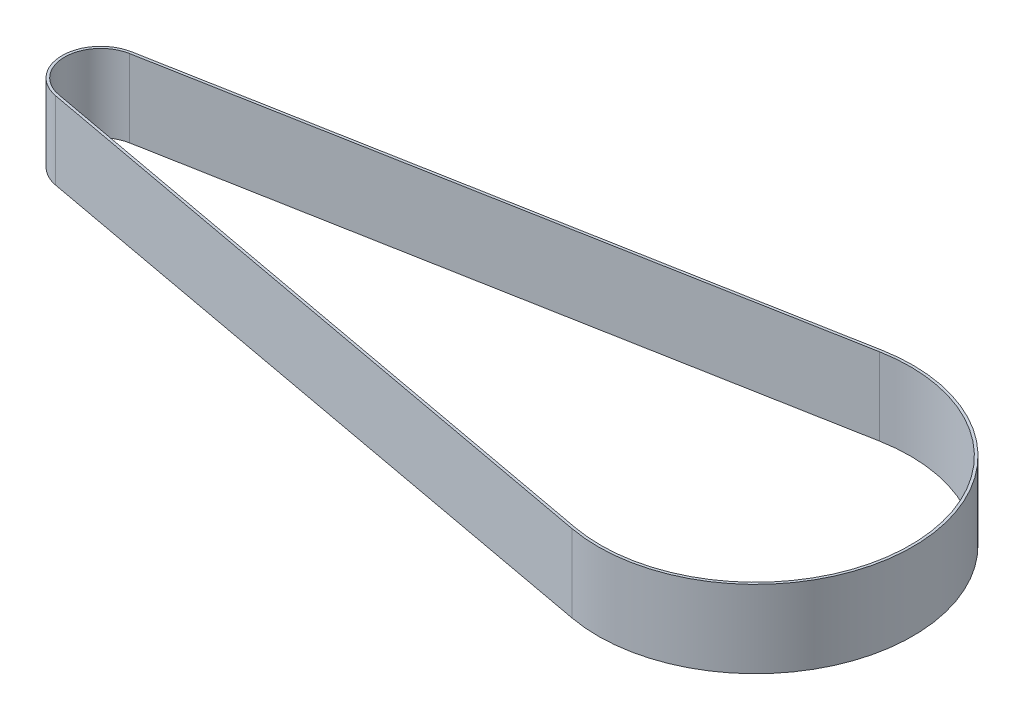
ISO-10303-21;
HEADER;
FILE_DESCRIPTION(('STEP AP214'),'2;1');
FILE_NAME('part.step','',(''),(''),'','','');
FILE_SCHEMA(('AUTOMOTIVE_DESIGN { 1 0 10303 214 1 1 1 1 }'));
ENDSEC;
DATA;
#1=APPLICATION_CONTEXT('core data for automotive mechanical design processes');
#2=APPLICATION_PROTOCOL_DEFINITION('international standard','automotive_design',2000,#1);
#3=PRODUCT_CONTEXT('',#1,'mechanical');
#4=PRODUCT('Part','Part','',(#3));
#5=PRODUCT_RELATED_PRODUCT_CATEGORY('part','',(#4));
#6=PRODUCT_DEFINITION_FORMATION('','',#4);
#7=PRODUCT_DEFINITION_CONTEXT('part definition',#1,'design');
#8=PRODUCT_DEFINITION('design','',#6,#7);
#9=PRODUCT_DEFINITION_SHAPE('','',#8);
#10=(LENGTH_UNIT() NAMED_UNIT(*) SI_UNIT(.MILLI.,.METRE.));
#11=(NAMED_UNIT(*) PLANE_ANGLE_UNIT() SI_UNIT($,.RADIAN.));
#12=(NAMED_UNIT(*) SI_UNIT($,.STERADIAN.) SOLID_ANGLE_UNIT());
#13=UNCERTAINTY_MEASURE_WITH_UNIT(LENGTH_MEASURE(1.E-05),#10,'distance_accuracy_value','');
#14=(GEOMETRIC_REPRESENTATION_CONTEXT(3) GLOBAL_UNCERTAINTY_ASSIGNED_CONTEXT((#13)) GLOBAL_UNIT_ASSIGNED_CONTEXT((#10,
#11,#12)) REPRESENTATION_CONTEXT('',''));
#15=CARTESIAN_POINT('',(0.,0.,0.));
#16=DIRECTION('',(0.,0.,1.));
#17=DIRECTION('',(1.,0.,0.));
#18=AXIS2_PLACEMENT_3D('',#15,#16,#17);
#19=CARTESIAN_POINT('',(0.,15.,0.));
#20=DIRECTION('',(0.,1.,0.));
#21=DIRECTION('',(0.,0.,1.));
#22=AXIS2_PLACEMENT_3D('',#19,#20,#21);
#23=PLANE('',#22);
#24=CARTESIAN_POINT('',(0.,15.,0.));
#25=DIRECTION('',(0.,1.,0.));
#26=DIRECTION('',(0.,0.,1.));
#27=AXIS2_PLACEMENT_3D('',#24,#25,#26);
#28=CIRCLE('',#27,7.5);
#29=CARTESIAN_POINT('',(-1.35933806146572,15.,-7.37578470636519));
#30=VERTEX_POINT('',#29);
#31=CARTESIAN_POINT('',(-1.35933806146572,15.,7.37578470636519));
#32=VERTEX_POINT('',#31);
#33=EDGE_CURVE('E134',#30,#32,#28,.T.);
#34=ORIENTED_EDGE('',*,*,#33,.T.);
#35=DIRECTION('',(0.983437960848692,0.,0.181245074862096));
#36=VECTOR('',#35,1.);
#37=CARTESIAN_POINT('',(-1.35933806146572,15.,7.37578470636519));
#38=LINE('',#37,#36);
#39=CARTESIAN_POINT('',(121.372025216706,15.,29.9948578058851));
#40=VERTEX_POINT('',#39);
#41=EDGE_CURVE('E137',#32,#40,#38,.T.);
#42=ORIENTED_EDGE('',*,*,#41,.T.);
#43=CARTESIAN_POINT('',(126.9,15.,0.));
#44=DIRECTION('',(0.,1.,0.));
#45=DIRECTION('',(0.,0.,1.));
#46=AXIS2_PLACEMENT_3D('',#43,#44,#45);
#47=CIRCLE('',#46,30.5);
#48=CARTESIAN_POINT('',(121.372025216706,15.,-29.9948578058851));
#49=VERTEX_POINT('',#48);
#50=EDGE_CURVE('E140',#40,#49,#47,.T.);
#51=ORIENTED_EDGE('',*,*,#50,.T.);
#52=DIRECTION('',(-0.983437960848692,0.,0.181245074862096));
#53=VECTOR('',#52,1.);
#54=CARTESIAN_POINT('',(-1.35933806146572,15.,-7.37578470636519));
#55=LINE('',#54,#53);
#56=EDGE_CURVE('E142',#49,#30,#55,.T.);
#57=ORIENTED_EDGE('',*,*,#56,.T.);
#58=EDGE_LOOP('',(#34,#42,#51,#57));
#59=FACE_BOUND('',#58,.T.);
#60=DIRECTION('',(0.983437960848692,0.,0.181245074862096));
#61=VECTOR('',#60,1.);
#62=CARTESIAN_POINT('',(-1.26871552403467,15.,6.88406572594084));
#63=LINE('',#62,#61);
#64=CARTESIAN_POINT('',(-1.26871552403467,15.,6.88406572594084));
#65=VERTEX_POINT('',#64);
#66=CARTESIAN_POINT('',(121.462647754137,15.,29.5031388254608));
#67=VERTEX_POINT('',#66);
#68=EDGE_CURVE('E106',#65,#67,#63,.T.);
#69=ORIENTED_EDGE('',*,*,#68,.F.);
#70=CARTESIAN_POINT('',(0.,15.,0.));
#71=DIRECTION('',(0.,1.,0.));
#72=DIRECTION('',(0.,0.,1.));
#73=AXIS2_PLACEMENT_3D('',#70,#71,#72);
#74=CIRCLE('',#73,7.);
#75=CARTESIAN_POINT('',(-1.26871552403467,15.,-6.88406572594084));
#76=VERTEX_POINT('',#75);
#77=EDGE_CURVE('E98',#76,#65,#74,.T.);
#78=ORIENTED_EDGE('',*,*,#77,.F.);
#79=DIRECTION('',(-0.983437960848692,0.,0.181245074862096));
#80=VECTOR('',#79,1.);
#81=CARTESIAN_POINT('',(-1.26871552403467,15.,-6.88406572594084));
#82=LINE('',#81,#80);
#83=CARTESIAN_POINT('',(121.462647754137,15.,-29.5031388254608));
#84=VERTEX_POINT('',#83);
#85=EDGE_CURVE('E120',#84,#76,#82,.T.);
#86=ORIENTED_EDGE('',*,*,#85,.F.);
#87=CARTESIAN_POINT('',(126.9,15.,0.));
#88=DIRECTION('',(0.,1.,0.));
#89=DIRECTION('',(0.,0.,1.));
#90=AXIS2_PLACEMENT_3D('',#87,#88,#89);
#91=CIRCLE('',#90,30.);
#92=EDGE_CURVE('E118',#67,#84,#91,.T.);
#93=ORIENTED_EDGE('',*,*,#92,.F.);
#94=EDGE_LOOP('',(#69,#78,#86,#93));
#95=FACE_BOUND('',#94,.T.);
#96=ADVANCED_FACE('F33',(#59,#95),#23,.T.);
#97=CARTESIAN_POINT('',(0.,0.,0.));
#98=DIRECTION('',(0.,1.,0.));
#99=DIRECTION('',(0.,0.,1.));
#100=AXIS2_PLACEMENT_3D('',#97,#98,#99);
#101=PLANE('',#100);
#102=CARTESIAN_POINT('',(0.,0.,0.));
#103=DIRECTION('',(0.,1.,0.));
#104=DIRECTION('',(0.,0.,1.));
#105=AXIS2_PLACEMENT_3D('',#102,#103,#104);
#106=CIRCLE('',#105,7.5);
#107=CARTESIAN_POINT('',(-1.35933806146572,0.,-7.37578470636519));
#108=VERTEX_POINT('',#107);
#109=CARTESIAN_POINT('',(-1.35933806146572,0.,7.37578470636519));
#110=VERTEX_POINT('',#109);
#111=EDGE_CURVE('E114',#108,#110,#106,.T.);
#112=ORIENTED_EDGE('',*,*,#111,.F.);
#113=DIRECTION('',(-0.983437960848692,0.,0.181245074862096));
#114=VECTOR('',#113,1.);
#115=CARTESIAN_POINT('',(-1.35933806146572,0.,-7.37578470636519));
#116=LINE('',#115,#114);
#117=CARTESIAN_POINT('',(121.372025216706,0.,-29.9948578058851));
#118=VERTEX_POINT('',#117);
#119=EDGE_CURVE('E138',#118,#108,#116,.T.);
#120=ORIENTED_EDGE('',*,*,#119,.F.);
#121=CARTESIAN_POINT('',(126.9,0.,0.));
#122=DIRECTION('',(0.,1.,0.));
#123=DIRECTION('',(0.,0.,1.));
#124=AXIS2_PLACEMENT_3D('',#121,#122,#123);
#125=CIRCLE('',#124,30.5);
#126=CARTESIAN_POINT('',(121.372025216706,0.,29.9948578058851));
#127=VERTEX_POINT('',#126);
#128=EDGE_CURVE('E149',#127,#118,#125,.T.);
#129=ORIENTED_EDGE('',*,*,#128,.F.);
#130=DIRECTION('',(0.983437960848692,0.,0.181245074862096));
#131=VECTOR('',#130,1.);
#132=CARTESIAN_POINT('',(-1.35933806146572,0.,7.37578470636519));
#133=LINE('',#132,#131);
#134=EDGE_CURVE('E147',#110,#127,#133,.T.);
#135=ORIENTED_EDGE('',*,*,#134,.F.);
#136=EDGE_LOOP('',(#112,#120,#129,#135));
#137=FACE_BOUND('',#136,.T.);
#138=CARTESIAN_POINT('',(0.,0.,0.));
#139=DIRECTION('',(0.,1.,0.));
#140=DIRECTION('',(0.,0.,1.));
#141=AXIS2_PLACEMENT_3D('',#138,#139,#140);
#142=CIRCLE('',#141,7.);
#143=CARTESIAN_POINT('',(-1.26871552403467,0.,-6.88406572594084));
#144=VERTEX_POINT('',#143);
#145=CARTESIAN_POINT('',(-1.26871552403467,0.,6.88406572594084));
#146=VERTEX_POINT('',#145);
#147=EDGE_CURVE('E56',#144,#146,#142,.T.);
#148=ORIENTED_EDGE('',*,*,#147,.T.);
#149=DIRECTION('',(0.983437960848692,0.,0.181245074862096));
#150=VECTOR('',#149,1.);
#151=CARTESIAN_POINT('',(-1.26871552403467,0.,6.88406572594084));
#152=LINE('',#151,#150);
#153=CARTESIAN_POINT('',(121.462647754137,0.,29.5031388254608));
#154=VERTEX_POINT('',#153);
#155=EDGE_CURVE('E113',#146,#154,#152,.T.);
#156=ORIENTED_EDGE('',*,*,#155,.T.);
#157=CARTESIAN_POINT('',(126.9,0.,0.));
#158=DIRECTION('',(0.,1.,0.));
#159=DIRECTION('',(0.,0.,1.));
#160=AXIS2_PLACEMENT_3D('',#157,#158,#159);
#161=CIRCLE('',#160,30.);
#162=CARTESIAN_POINT('',(121.462647754137,0.,-29.5031388254608));
#163=VERTEX_POINT('',#162);
#164=EDGE_CURVE('E126',#154,#163,#161,.T.);
#165=ORIENTED_EDGE('',*,*,#164,.T.);
#166=DIRECTION('',(-0.983437960848692,0.,0.181245074862096));
#167=VECTOR('',#166,1.);
#168=CARTESIAN_POINT('',(-1.26871552403467,0.,-6.88406572594084));
#169=LINE('',#168,#167);
#170=EDGE_CURVE('E107',#163,#144,#169,.T.);
#171=ORIENTED_EDGE('',*,*,#170,.T.);
#172=EDGE_LOOP('',(#148,#156,#165,#171));
#173=FACE_BOUND('',#172,.T.);
#174=ADVANCED_FACE('F167',(#137,#173),#101,.F.);
#175=CARTESIAN_POINT('',(0.,15.,0.));
#176=DIRECTION('',(0.,-1.,0.));
#177=DIRECTION('',(0.,0.,-1.));
#178=AXIS2_PLACEMENT_3D('',#175,#176,#177);
#179=CYLINDRICAL_SURFACE('',#178,7.5);
#180=ORIENTED_EDGE('',*,*,#111,.T.);
#181=DIRECTION('',(0.,-1.,0.));
#182=VECTOR('',#181,1.);
#183=CARTESIAN_POINT('',(-1.35933806146572,15.,7.37578470636519));
#184=LINE('',#183,#182);
#185=EDGE_CURVE('E11',#32,#110,#184,.T.);
#186=ORIENTED_EDGE('',*,*,#185,.F.);
#187=ORIENTED_EDGE('',*,*,#33,.F.);
#188=DIRECTION('',(0.,-1.,0.));
#189=VECTOR('',#188,1.);
#190=CARTESIAN_POINT('',(-1.35933806146572,15.,-7.37578470636519));
#191=LINE('',#190,#189);
#192=EDGE_CURVE('E144',#30,#108,#191,.T.);
#193=ORIENTED_EDGE('',*,*,#192,.T.);
#194=EDGE_LOOP('',(#180,#186,#187,#193));
#195=FACE_BOUND('',#194,.T.);
#196=ADVANCED_FACE('F35',(#195),#179,.T.);
#197=CARTESIAN_POINT('',(-1.35933806146572,15.,7.37578470636519));
#198=DIRECTION('',(0.181245074862096,0.,-0.983437960848692));
#199=DIRECTION('',(-0.983437960848692,0.,-0.181245074862096));
#200=AXIS2_PLACEMENT_3D('',#197,#198,#199);
#201=PLANE('',#200);
#202=ORIENTED_EDGE('',*,*,#134,.T.);
#203=DIRECTION('',(0.,-1.,0.));
#204=VECTOR('',#203,1.);
#205=CARTESIAN_POINT('',(121.372025216706,15.,29.9948578058851));
#206=LINE('',#205,#204);
#207=EDGE_CURVE('E41',#40,#127,#206,.T.);
#208=ORIENTED_EDGE('',*,*,#207,.F.);
#209=ORIENTED_EDGE('',*,*,#41,.F.);
#210=ORIENTED_EDGE('',*,*,#185,.T.);
#211=EDGE_LOOP('',(#202,#208,#209,#210));
#212=FACE_BOUND('',#211,.T.);
#213=ADVANCED_FACE('F177',(#212),#201,.F.);
#214=CARTESIAN_POINT('',(126.9,15.,0.));
#215=DIRECTION('',(0.,-1.,0.));
#216=DIRECTION('',(0.,0.,-1.));
#217=AXIS2_PLACEMENT_3D('',#214,#215,#216);
#218=CYLINDRICAL_SURFACE('',#217,30.5);
#219=ORIENTED_EDGE('',*,*,#128,.T.);
#220=DIRECTION('',(0.,-1.,0.));
#221=VECTOR('',#220,1.);
#222=CARTESIAN_POINT('',(121.372025216706,15.,-29.9948578058851));
#223=LINE('',#222,#221);
#224=EDGE_CURVE('E154',#49,#118,#223,.T.);
#225=ORIENTED_EDGE('',*,*,#224,.F.);
#226=ORIENTED_EDGE('',*,*,#50,.F.);
#227=ORIENTED_EDGE('',*,*,#207,.T.);
#228=EDGE_LOOP('',(#219,#225,#226,#227));
#229=FACE_BOUND('',#228,.T.);
#230=ADVANCED_FACE('F161',(#229),#218,.T.);
#231=CARTESIAN_POINT('',(-1.35933806146572,15.,-7.37578470636519));
#232=DIRECTION('',(0.181245074862096,0.,0.983437960848692));
#233=DIRECTION('',(0.983437960848692,0.,-0.181245074862096));
#234=AXIS2_PLACEMENT_3D('',#231,#232,#233);
#235=PLANE('',#234);
#236=ORIENTED_EDGE('',*,*,#119,.T.);
#237=ORIENTED_EDGE('',*,*,#192,.F.);
#238=ORIENTED_EDGE('',*,*,#56,.F.);
#239=ORIENTED_EDGE('',*,*,#224,.T.);
#240=EDGE_LOOP('',(#236,#237,#238,#239));
#241=FACE_BOUND('',#240,.T.);
#242=ADVANCED_FACE('F171',(#241),#235,.F.);
#243=CARTESIAN_POINT('',(0.,15.,0.));
#244=DIRECTION('',(0.,-1.,0.));
#245=DIRECTION('',(0.,0.,-1.));
#246=AXIS2_PLACEMENT_3D('',#243,#244,#245);
#247=CYLINDRICAL_SURFACE('',#246,7.);
#248=ORIENTED_EDGE('',*,*,#147,.F.);
#249=DIRECTION('',(0.,-1.,0.));
#250=VECTOR('',#249,1.);
#251=CARTESIAN_POINT('',(-1.26871552403467,15.,-6.88406572594084));
#252=LINE('',#251,#250);
#253=EDGE_CURVE('E102',#76,#144,#252,.T.);
#254=ORIENTED_EDGE('',*,*,#253,.F.);
#255=ORIENTED_EDGE('',*,*,#77,.T.);
#256=DIRECTION('',(0.,-1.,0.));
#257=VECTOR('',#256,1.);
#258=CARTESIAN_POINT('',(-1.26871552403467,15.,6.88406572594084));
#259=LINE('',#258,#257);
#260=EDGE_CURVE('E101',#65,#146,#259,.T.);
#261=ORIENTED_EDGE('',*,*,#260,.T.);
#262=EDGE_LOOP('',(#248,#254,#255,#261));
#263=FACE_BOUND('',#262,.T.);
#264=ADVANCED_FACE('F100',(#263),#247,.F.);
#265=CARTESIAN_POINT('',(-1.26871552403467,15.,6.88406572594084));
#266=DIRECTION('',(0.181245074862096,0.,-0.983437960848692));
#267=DIRECTION('',(-0.983437960848692,0.,-0.181245074862096));
#268=AXIS2_PLACEMENT_3D('',#265,#266,#267);
#269=PLANE('',#268);
#270=ORIENTED_EDGE('',*,*,#155,.F.);
#271=ORIENTED_EDGE('',*,*,#260,.F.);
#272=ORIENTED_EDGE('',*,*,#68,.T.);
#273=DIRECTION('',(0.,-1.,0.));
#274=VECTOR('',#273,1.);
#275=CARTESIAN_POINT('',(121.462647754137,15.,29.5031388254608));
#276=LINE('',#275,#274);
#277=EDGE_CURVE('E115',#67,#154,#276,.T.);
#278=ORIENTED_EDGE('',*,*,#277,.T.);
#279=EDGE_LOOP('',(#270,#271,#272,#278));
#280=FACE_BOUND('',#279,.T.);
#281=ADVANCED_FACE('F110',(#280),#269,.T.);
#282=CARTESIAN_POINT('',(126.9,15.,0.));
#283=DIRECTION('',(0.,-1.,0.));
#284=DIRECTION('',(0.,0.,-1.));
#285=AXIS2_PLACEMENT_3D('',#282,#283,#284);
#286=CYLINDRICAL_SURFACE('',#285,30.);
#287=ORIENTED_EDGE('',*,*,#164,.F.);
#288=ORIENTED_EDGE('',*,*,#277,.F.);
#289=ORIENTED_EDGE('',*,*,#92,.T.);
#290=DIRECTION('',(0.,-1.,0.));
#291=VECTOR('',#290,1.);
#292=CARTESIAN_POINT('',(121.462647754137,15.,-29.5031388254608));
#293=LINE('',#292,#291);
#294=EDGE_CURVE('E48',#84,#163,#293,.T.);
#295=ORIENTED_EDGE('',*,*,#294,.T.);
#296=EDGE_LOOP('',(#287,#288,#289,#295));
#297=FACE_BOUND('',#296,.T.);
#298=ADVANCED_FACE('F200',(#297),#286,.F.);
#299=CARTESIAN_POINT('',(-1.26871552403467,15.,-6.88406572594084));
#300=DIRECTION('',(0.181245074862096,0.,0.983437960848692));
#301=DIRECTION('',(0.983437960848692,0.,-0.181245074862096));
#302=AXIS2_PLACEMENT_3D('',#299,#300,#301);
#303=PLANE('',#302);
#304=ORIENTED_EDGE('',*,*,#170,.F.);
#305=ORIENTED_EDGE('',*,*,#294,.F.);
#306=ORIENTED_EDGE('',*,*,#85,.T.);
#307=ORIENTED_EDGE('',*,*,#253,.T.);
#308=EDGE_LOOP('',(#304,#305,#306,#307));
#309=FACE_BOUND('',#308,.T.);
#310=ADVANCED_FACE('F204',(#309),#303,.T.);
#311=CLOSED_SHELL('',(#96,#174,#196,#213,#230,#242,#264,#281,#298,#310));
#312=MANIFOLD_SOLID_BREP('B2',#311);
#313=ADVANCED_BREP_SHAPE_REPRESENTATION('',(#18,#312),#14);
#314=SHAPE_DEFINITION_REPRESENTATION(#9,#313);
ENDSEC;
END-ISO-10303-21;
